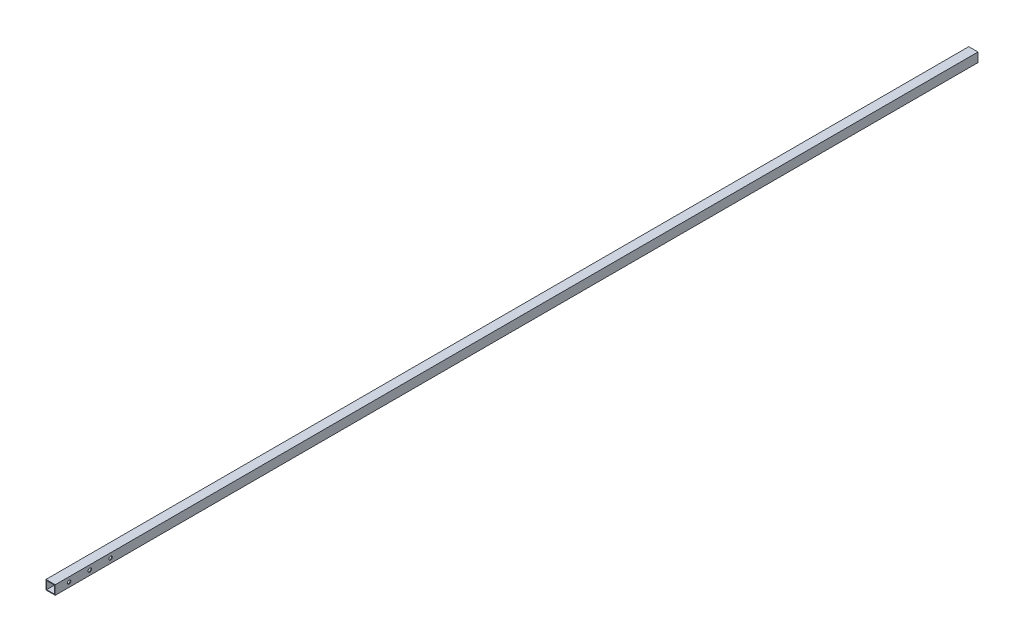
ISO-10303-21;
HEADER;
FILE_DESCRIPTION(('STEP AP214'),'2;1');
FILE_NAME('part.step','',(''),(''),'','','');
FILE_SCHEMA(('AUTOMOTIVE_DESIGN { 1 0 10303 214 1 1 1 1 }'));
ENDSEC;
DATA;
#1=APPLICATION_CONTEXT('core data for automotive mechanical design processes');
#2=APPLICATION_PROTOCOL_DEFINITION('international standard','automotive_design',2000,#1);
#3=PRODUCT_CONTEXT('',#1,'mechanical');
#4=PRODUCT('Part','Part','',(#3));
#5=PRODUCT_RELATED_PRODUCT_CATEGORY('part','',(#4));
#6=PRODUCT_DEFINITION_FORMATION('','',#4);
#7=PRODUCT_DEFINITION_CONTEXT('part definition',#1,'design');
#8=PRODUCT_DEFINITION('design','',#6,#7);
#9=PRODUCT_DEFINITION_SHAPE('','',#8);
#10=(LENGTH_UNIT() NAMED_UNIT(*) SI_UNIT(.MILLI.,.METRE.));
#11=(NAMED_UNIT(*) PLANE_ANGLE_UNIT() SI_UNIT($,.RADIAN.));
#12=(NAMED_UNIT(*) SI_UNIT($,.STERADIAN.) SOLID_ANGLE_UNIT());
#13=UNCERTAINTY_MEASURE_WITH_UNIT(LENGTH_MEASURE(1.E-05),#10,'distance_accuracy_value','');
#14=(GEOMETRIC_REPRESENTATION_CONTEXT(3) GLOBAL_UNCERTAINTY_ASSIGNED_CONTEXT((#13)) GLOBAL_UNIT_ASSIGNED_CONTEXT((#10,
#11,#12)) REPRESENTATION_CONTEXT('',''));
#15=CARTESIAN_POINT('',(0.,0.,0.));
#16=DIRECTION('',(0.,0.,1.));
#17=DIRECTION('',(1.,0.,0.));
#18=AXIS2_PLACEMENT_3D('',#15,#16,#17);
#19=CARTESIAN_POINT('',(0.,0.,4000.));
#20=DIRECTION('',(0.,0.,1.));
#21=DIRECTION('',(1.,0.,0.));
#22=AXIS2_PLACEMENT_3D('',#19,#20,#21);
#23=PLANE('',#22);
#24=DIRECTION('',(0.,1.,0.));
#25=VECTOR('',#24,1.);
#26=CARTESIAN_POINT('',(20.,20.,4000.));
#27=LINE('',#26,#25);
#28=CARTESIAN_POINT('',(20.,-20.,4000.));
#29=VERTEX_POINT('',#28);
#30=CARTESIAN_POINT('',(20.,20.,4000.));
#31=VERTEX_POINT('',#30);
#32=EDGE_CURVE('E144',#29,#31,#27,.T.);
#33=ORIENTED_EDGE('',*,*,#32,.T.);
#34=DIRECTION('',(-1.,0.,0.));
#35=VECTOR('',#34,1.);
#36=CARTESIAN_POINT('',(-20.,20.,4000.));
#37=LINE('',#36,#35);
#38=CARTESIAN_POINT('',(-20.,20.,4000.));
#39=VERTEX_POINT('',#38);
#40=EDGE_CURVE('E147',#31,#39,#37,.T.);
#41=ORIENTED_EDGE('',*,*,#40,.T.);
#42=DIRECTION('',(0.,-1.,0.));
#43=VECTOR('',#42,1.);
#44=CARTESIAN_POINT('',(-20.,20.,4000.));
#45=LINE('',#44,#43);
#46=CARTESIAN_POINT('',(-20.,-20.,4000.));
#47=VERTEX_POINT('',#46);
#48=EDGE_CURVE('E150',#39,#47,#45,.T.);
#49=ORIENTED_EDGE('',*,*,#48,.T.);
#50=DIRECTION('',(1.,0.,0.));
#51=VECTOR('',#50,1.);
#52=CARTESIAN_POINT('',(-20.,-20.,4000.));
#53=LINE('',#52,#51);
#54=EDGE_CURVE('E152',#47,#29,#53,.T.);
#55=ORIENTED_EDGE('',*,*,#54,.T.);
#56=EDGE_LOOP('',(#33,#41,#49,#55));
#57=FACE_BOUND('',#56,.T.);
#58=DIRECTION('',(1.,0.,0.));
#59=VECTOR('',#58,1.);
#60=CARTESIAN_POINT('',(-17.,-17.,4000.));
#61=LINE('',#60,#59);
#62=CARTESIAN_POINT('',(-17.,-17.,4000.));
#63=VERTEX_POINT('',#62);
#64=CARTESIAN_POINT('',(17.,-17.,4000.));
#65=VERTEX_POINT('',#64);
#66=EDGE_CURVE('E114',#63,#65,#61,.T.);
#67=ORIENTED_EDGE('',*,*,#66,.F.);
#68=DIRECTION('',(0.,-1.,0.));
#69=VECTOR('',#68,1.);
#70=CARTESIAN_POINT('',(-17.,17.,4000.));
#71=LINE('',#70,#69);
#72=CARTESIAN_POINT('',(-17.,17.,4000.));
#73=VERTEX_POINT('',#72);
#74=EDGE_CURVE('E106',#73,#63,#71,.T.);
#75=ORIENTED_EDGE('',*,*,#74,.F.);
#76=DIRECTION('',(-1.,0.,0.));
#77=VECTOR('',#76,1.);
#78=CARTESIAN_POINT('',(-17.,17.,4000.));
#79=LINE('',#78,#77);
#80=CARTESIAN_POINT('',(17.,17.,4000.));
#81=VERTEX_POINT('',#80);
#82=EDGE_CURVE('E128',#81,#73,#79,.T.);
#83=ORIENTED_EDGE('',*,*,#82,.F.);
#84=DIRECTION('',(0.,1.,0.));
#85=VECTOR('',#84,1.);
#86=CARTESIAN_POINT('',(17.,17.,4000.));
#87=LINE('',#86,#85);
#88=EDGE_CURVE('E126',#65,#81,#87,.T.);
#89=ORIENTED_EDGE('',*,*,#88,.F.);
#90=EDGE_LOOP('',(#67,#75,#83,#89));
#91=FACE_BOUND('',#90,.T.);
#92=ADVANCED_FACE('F39',(#57,#91),#23,.T.);
#93=CARTESIAN_POINT('',(0.,0.,0.));
#94=DIRECTION('',(0.,0.,1.));
#95=DIRECTION('',(1.,0.,0.));
#96=AXIS2_PLACEMENT_3D('',#93,#94,#95);
#97=PLANE('',#96);
#98=DIRECTION('',(0.,1.,0.));
#99=VECTOR('',#98,1.);
#100=CARTESIAN_POINT('',(20.,20.,0.));
#101=LINE('',#100,#99);
#102=CARTESIAN_POINT('',(20.,-20.,0.));
#103=VERTEX_POINT('',#102);
#104=CARTESIAN_POINT('',(20.,20.,0.));
#105=VERTEX_POINT('',#104);
#106=EDGE_CURVE('E122',#103,#105,#101,.T.);
#107=ORIENTED_EDGE('',*,*,#106,.F.);
#108=DIRECTION('',(1.,0.,0.));
#109=VECTOR('',#108,1.);
#110=CARTESIAN_POINT('',(-20.,-20.,0.));
#111=LINE('',#110,#109);
#112=CARTESIAN_POINT('',(-20.,-20.,0.));
#113=VERTEX_POINT('',#112);
#114=EDGE_CURVE('E148',#113,#103,#111,.T.);
#115=ORIENTED_EDGE('',*,*,#114,.F.);
#116=DIRECTION('',(0.,-1.,0.));
#117=VECTOR('',#116,1.);
#118=CARTESIAN_POINT('',(-20.,20.,0.));
#119=LINE('',#118,#117);
#120=CARTESIAN_POINT('',(-20.,20.,0.));
#121=VERTEX_POINT('',#120);
#122=EDGE_CURVE('E159',#121,#113,#119,.T.);
#123=ORIENTED_EDGE('',*,*,#122,.F.);
#124=DIRECTION('',(-1.,0.,0.));
#125=VECTOR('',#124,1.);
#126=CARTESIAN_POINT('',(-20.,20.,0.));
#127=LINE('',#126,#125);
#128=EDGE_CURVE('E157',#105,#121,#127,.T.);
#129=ORIENTED_EDGE('',*,*,#128,.F.);
#130=EDGE_LOOP('',(#107,#115,#123,#129));
#131=FACE_BOUND('',#130,.T.);
#132=DIRECTION('',(0.,-1.,0.));
#133=VECTOR('',#132,1.);
#134=CARTESIAN_POINT('',(-17.,17.,0.));
#135=LINE('',#134,#133);
#136=CARTESIAN_POINT('',(-17.,17.,0.));
#137=VERTEX_POINT('',#136);
#138=CARTESIAN_POINT('',(-17.,-17.,0.));
#139=VERTEX_POINT('',#138);
#140=EDGE_CURVE('E64',#137,#139,#135,.T.);
#141=ORIENTED_EDGE('',*,*,#140,.T.);
#142=DIRECTION('',(1.,0.,0.));
#143=VECTOR('',#142,1.);
#144=CARTESIAN_POINT('',(-17.,-17.,0.));
#145=LINE('',#144,#143);
#146=CARTESIAN_POINT('',(17.,-17.,0.));
#147=VERTEX_POINT('',#146);
#148=EDGE_CURVE('E121',#139,#147,#145,.T.);
#149=ORIENTED_EDGE('',*,*,#148,.T.);
#150=DIRECTION('',(0.,1.,0.));
#151=VECTOR('',#150,1.);
#152=CARTESIAN_POINT('',(17.,17.,0.));
#153=LINE('',#152,#151);
#154=CARTESIAN_POINT('',(17.,17.,0.));
#155=VERTEX_POINT('',#154);
#156=EDGE_CURVE('E136',#147,#155,#153,.T.);
#157=ORIENTED_EDGE('',*,*,#156,.T.);
#158=DIRECTION('',(-1.,0.,0.));
#159=VECTOR('',#158,1.);
#160=CARTESIAN_POINT('',(-17.,17.,0.));
#161=LINE('',#160,#159);
#162=EDGE_CURVE('E115',#155,#137,#161,.T.);
#163=ORIENTED_EDGE('',*,*,#162,.T.);
#164=EDGE_LOOP('',(#141,#149,#157,#163));
#165=FACE_BOUND('',#164,.T.);
#166=ADVANCED_FACE('F206',(#131,#165),#97,.F.);
#167=CARTESIAN_POINT('',(20.,20.,4000.));
#168=DIRECTION('',(-1.,0.,0.));
#169=DIRECTION('',(0.,-1.,0.));
#170=AXIS2_PLACEMENT_3D('',#167,#168,#169);
#171=PLANE('',#170);
#172=CARTESIAN_POINT('',(20.,0.,3940.));
#173=DIRECTION('',(1.,0.,0.));
#174=DIRECTION('',(0.,1.,0.));
#175=AXIS2_PLACEMENT_3D('',#172,#173,#174);
#176=CIRCLE('',#175,7.49999999999995);
#177=CARTESIAN_POINT('',(20.,7.49999999999995,3940.));
#178=VERTEX_POINT('',#177);
#179=EDGE_CURVE('E260',#178,#178,#176,.T.);
#180=ORIENTED_EDGE('',*,*,#179,.F.);
#181=EDGE_LOOP('',(#180));
#182=FACE_BOUND('',#181,.T.);
#183=CARTESIAN_POINT('',(20.,0.,3850.));
#184=DIRECTION('',(1.,0.,0.));
#185=DIRECTION('',(0.,1.,0.));
#186=AXIS2_PLACEMENT_3D('',#183,#184,#185);
#187=CIRCLE('',#186,7.49999999999995);
#188=CARTESIAN_POINT('',(20.,7.49999999999995,3850.));
#189=VERTEX_POINT('',#188);
#190=EDGE_CURVE('E264',#189,#189,#187,.T.);
#191=ORIENTED_EDGE('',*,*,#190,.F.);
#192=EDGE_LOOP('',(#191));
#193=FACE_BOUND('',#192,.T.);
#194=CARTESIAN_POINT('',(20.,0.,3760.));
#195=DIRECTION('',(1.,0.,0.));
#196=DIRECTION('',(0.,1.,0.));
#197=AXIS2_PLACEMENT_3D('',#194,#195,#196);
#198=CIRCLE('',#197,7.49999999999995);
#199=CARTESIAN_POINT('',(20.,7.49999999999995,3760.));
#200=VERTEX_POINT('',#199);
#201=EDGE_CURVE('E185',#200,#200,#198,.T.);
#202=ORIENTED_EDGE('',*,*,#201,.F.);
#203=EDGE_LOOP('',(#202));
#204=FACE_BOUND('',#203,.T.);
#205=ORIENTED_EDGE('',*,*,#106,.T.);
#206=DIRECTION('',(0.,0.,-1.));
#207=VECTOR('',#206,1.);
#208=CARTESIAN_POINT('',(20.,20.,4000.));
#209=LINE('',#208,#207);
#210=EDGE_CURVE('E11',#31,#105,#209,.T.);
#211=ORIENTED_EDGE('',*,*,#210,.F.);
#212=ORIENTED_EDGE('',*,*,#32,.F.);
#213=DIRECTION('',(0.,0.,-1.));
#214=VECTOR('',#213,1.);
#215=CARTESIAN_POINT('',(20.,-20.,4000.));
#216=LINE('',#215,#214);
#217=EDGE_CURVE('E154',#29,#103,#216,.T.);
#218=ORIENTED_EDGE('',*,*,#217,.T.);
#219=EDGE_LOOP('',(#205,#211,#212,#218));
#220=FACE_BOUND('',#219,.T.);
#221=ADVANCED_FACE('F41',(#182,#193,#204,#220),#171,.F.);
#222=CARTESIAN_POINT('',(-20.,20.,4000.));
#223=DIRECTION('',(0.,-1.,0.));
#224=DIRECTION('',(0.,0.,-1.));
#225=AXIS2_PLACEMENT_3D('',#222,#223,#224);
#226=PLANE('',#225);
#227=ORIENTED_EDGE('',*,*,#128,.T.);
#228=DIRECTION('',(0.,0.,-1.));
#229=VECTOR('',#228,1.);
#230=CARTESIAN_POINT('',(-20.,20.,4000.));
#231=LINE('',#230,#229);
#232=EDGE_CURVE('E48',#39,#121,#231,.T.);
#233=ORIENTED_EDGE('',*,*,#232,.F.);
#234=ORIENTED_EDGE('',*,*,#40,.F.);
#235=ORIENTED_EDGE('',*,*,#210,.T.);
#236=EDGE_LOOP('',(#227,#233,#234,#235));
#237=FACE_BOUND('',#236,.T.);
#238=ADVANCED_FACE('F236',(#237),#226,.F.);
#239=CARTESIAN_POINT('',(-20.,20.,4000.));
#240=DIRECTION('',(1.,0.,0.));
#241=DIRECTION('',(0.,1.,0.));
#242=AXIS2_PLACEMENT_3D('',#239,#240,#241);
#243=PLANE('',#242);
#244=CARTESIAN_POINT('',(-20.,0.,3940.));
#245=DIRECTION('',(1.,0.,0.));
#246=DIRECTION('',(0.,1.,0.));
#247=AXIS2_PLACEMENT_3D('',#244,#245,#246);
#248=CIRCLE('',#247,7.49999999999995);
#249=CARTESIAN_POINT('',(-20.,7.49999999999994,3940.));
#250=VERTEX_POINT('',#249);
#251=EDGE_CURVE('E172',#250,#250,#248,.T.);
#252=ORIENTED_EDGE('',*,*,#251,.T.);
#253=EDGE_LOOP('',(#252));
#254=FACE_BOUND('',#253,.T.);
#255=CARTESIAN_POINT('',(-20.,0.,3850.));
#256=DIRECTION('',(1.,0.,0.));
#257=DIRECTION('',(0.,1.,0.));
#258=AXIS2_PLACEMENT_3D('',#255,#256,#257);
#259=CIRCLE('',#258,7.49999999999995);
#260=CARTESIAN_POINT('',(-20.,7.49999999999994,3850.));
#261=VERTEX_POINT('',#260);
#262=EDGE_CURVE('E272',#261,#261,#259,.T.);
#263=ORIENTED_EDGE('',*,*,#262,.T.);
#264=EDGE_LOOP('',(#263));
#265=FACE_BOUND('',#264,.T.);
#266=CARTESIAN_POINT('',(-20.,0.,3760.));
#267=DIRECTION('',(1.,0.,0.));
#268=DIRECTION('',(0.,1.,0.));
#269=AXIS2_PLACEMENT_3D('',#266,#267,#268);
#270=CIRCLE('',#269,7.49999999999995);
#271=CARTESIAN_POINT('',(-20.,7.49999999999994,3760.));
#272=VERTEX_POINT('',#271);
#273=EDGE_CURVE('E268',#272,#272,#270,.T.);
#274=ORIENTED_EDGE('',*,*,#273,.T.);
#275=EDGE_LOOP('',(#274));
#276=FACE_BOUND('',#275,.T.);
#277=ORIENTED_EDGE('',*,*,#122,.T.);
#278=DIRECTION('',(0.,0.,-1.));
#279=VECTOR('',#278,1.);
#280=CARTESIAN_POINT('',(-20.,-20.,4000.));
#281=LINE('',#280,#279);
#282=EDGE_CURVE('E164',#47,#113,#281,.T.);
#283=ORIENTED_EDGE('',*,*,#282,.F.);
#284=ORIENTED_EDGE('',*,*,#48,.F.);
#285=ORIENTED_EDGE('',*,*,#232,.T.);
#286=EDGE_LOOP('',(#277,#283,#284,#285));
#287=FACE_BOUND('',#286,.T.);
#288=ADVANCED_FACE('F233',(#254,#265,#276,#287),#243,.F.);
#289=CARTESIAN_POINT('',(-20.,-20.,4000.));
#290=DIRECTION('',(0.,1.,0.));
#291=DIRECTION('',(0.,0.,1.));
#292=AXIS2_PLACEMENT_3D('',#289,#290,#291);
#293=PLANE('',#292);
#294=ORIENTED_EDGE('',*,*,#114,.T.);
#295=ORIENTED_EDGE('',*,*,#217,.F.);
#296=ORIENTED_EDGE('',*,*,#54,.F.);
#297=ORIENTED_EDGE('',*,*,#282,.T.);
#298=EDGE_LOOP('',(#294,#295,#296,#297));
#299=FACE_BOUND('',#298,.T.);
#300=ADVANCED_FACE('F230',(#299),#293,.F.);
#301=CARTESIAN_POINT('',(-17.,17.,4000.));
#302=DIRECTION('',(1.,0.,0.));
#303=DIRECTION('',(0.,0.,-1.));
#304=AXIS2_PLACEMENT_3D('',#301,#302,#303);
#305=PLANE('',#304);
#306=CARTESIAN_POINT('',(-17.,0.,3940.));
#307=DIRECTION('',(1.,0.,0.));
#308=DIRECTION('',(0.,0.,-1.));
#309=AXIS2_PLACEMENT_3D('',#306,#307,#308);
#310=CIRCLE('',#309,7.49999999999995);
#311=CARTESIAN_POINT('',(-17.,0.,3932.5));
#312=VERTEX_POINT('',#311);
#313=EDGE_CURVE('E134',#312,#312,#310,.T.);
#314=ORIENTED_EDGE('',*,*,#313,.F.);
#315=EDGE_LOOP('',(#314));
#316=FACE_BOUND('',#315,.T.);
#317=CARTESIAN_POINT('',(-17.,0.,3850.));
#318=DIRECTION('',(1.,0.,0.));
#319=DIRECTION('',(0.,0.,-1.));
#320=AXIS2_PLACEMENT_3D('',#317,#318,#319);
#321=CIRCLE('',#320,7.49999999999995);
#322=CARTESIAN_POINT('',(-17.,0.,3842.5));
#323=VERTEX_POINT('',#322);
#324=EDGE_CURVE('E175',#323,#323,#321,.T.);
#325=ORIENTED_EDGE('',*,*,#324,.F.);
#326=EDGE_LOOP('',(#325));
#327=FACE_BOUND('',#326,.T.);
#328=CARTESIAN_POINT('',(-17.,0.,3760.));
#329=DIRECTION('',(1.,0.,0.));
#330=DIRECTION('',(0.,0.,-1.));
#331=AXIS2_PLACEMENT_3D('',#328,#329,#330);
#332=CIRCLE('',#331,7.49999999999995);
#333=CARTESIAN_POINT('',(-17.,0.,3752.5));
#334=VERTEX_POINT('',#333);
#335=EDGE_CURVE('E171',#334,#334,#332,.T.);
#336=ORIENTED_EDGE('',*,*,#335,.F.);
#337=EDGE_LOOP('',(#336));
#338=FACE_BOUND('',#337,.T.);
#339=ORIENTED_EDGE('',*,*,#140,.F.);
#340=DIRECTION('',(0.,0.,-1.));
#341=VECTOR('',#340,1.);
#342=CARTESIAN_POINT('',(-17.,17.,4000.));
#343=LINE('',#342,#341);
#344=EDGE_CURVE('E110',#73,#137,#343,.T.);
#345=ORIENTED_EDGE('',*,*,#344,.F.);
#346=ORIENTED_EDGE('',*,*,#74,.T.);
#347=DIRECTION('',(0.,0.,-1.));
#348=VECTOR('',#347,1.);
#349=CARTESIAN_POINT('',(-17.,-17.,4000.));
#350=LINE('',#349,#348);
#351=EDGE_CURVE('E109',#63,#139,#350,.T.);
#352=ORIENTED_EDGE('',*,*,#351,.T.);
#353=EDGE_LOOP('',(#339,#345,#346,#352));
#354=FACE_BOUND('',#353,.T.);
#355=ADVANCED_FACE('F108',(#316,#327,#338,#354),#305,.T.);
#356=CARTESIAN_POINT('',(-17.,-17.,4000.));
#357=DIRECTION('',(0.,1.,0.));
#358=DIRECTION('',(-1.,0.,0.));
#359=AXIS2_PLACEMENT_3D('',#356,#357,#358);
#360=PLANE('',#359);
#361=ORIENTED_EDGE('',*,*,#148,.F.);
#362=ORIENTED_EDGE('',*,*,#351,.F.);
#363=ORIENTED_EDGE('',*,*,#66,.T.);
#364=DIRECTION('',(0.,0.,-1.));
#365=VECTOR('',#364,1.);
#366=CARTESIAN_POINT('',(17.,-17.,4000.));
#367=LINE('',#366,#365);
#368=EDGE_CURVE('E123',#65,#147,#367,.T.);
#369=ORIENTED_EDGE('',*,*,#368,.T.);
#370=EDGE_LOOP('',(#361,#362,#363,#369));
#371=FACE_BOUND('',#370,.T.);
#372=ADVANCED_FACE('F118',(#371),#360,.T.);
#373=CARTESIAN_POINT('',(17.,17.,4000.));
#374=DIRECTION('',(-1.,0.,0.));
#375=DIRECTION('',(0.,0.,1.));
#376=AXIS2_PLACEMENT_3D('',#373,#374,#375);
#377=PLANE('',#376);
#378=CARTESIAN_POINT('',(17.,0.,3940.));
#379=DIRECTION('',(-1.,0.,0.));
#380=DIRECTION('',(0.,0.,1.));
#381=AXIS2_PLACEMENT_3D('',#378,#379,#380);
#382=CIRCLE('',#381,7.49999999999995);
#383=CARTESIAN_POINT('',(17.,0.,3947.5));
#384=VERTEX_POINT('',#383);
#385=EDGE_CURVE('E43',#384,#384,#382,.T.);
#386=ORIENTED_EDGE('',*,*,#385,.F.);
#387=EDGE_LOOP('',(#386));
#388=FACE_BOUND('',#387,.T.);
#389=CARTESIAN_POINT('',(17.,0.,3850.));
#390=DIRECTION('',(-1.,0.,0.));
#391=DIRECTION('',(0.,0.,1.));
#392=AXIS2_PLACEMENT_3D('',#389,#390,#391);
#393=CIRCLE('',#392,7.49999999999995);
#394=CARTESIAN_POINT('',(17.,0.,3857.5));
#395=VERTEX_POINT('',#394);
#396=EDGE_CURVE('E173',#395,#395,#393,.T.);
#397=ORIENTED_EDGE('',*,*,#396,.F.);
#398=EDGE_LOOP('',(#397));
#399=FACE_BOUND('',#398,.T.);
#400=CARTESIAN_POINT('',(17.,0.,3760.));
#401=DIRECTION('',(-1.,0.,0.));
#402=DIRECTION('',(0.,0.,1.));
#403=AXIS2_PLACEMENT_3D('',#400,#401,#402);
#404=CIRCLE('',#403,7.49999999999995);
#405=CARTESIAN_POINT('',(17.,0.,3767.5));
#406=VERTEX_POINT('',#405);
#407=EDGE_CURVE('E169',#406,#406,#404,.T.);
#408=ORIENTED_EDGE('',*,*,#407,.F.);
#409=EDGE_LOOP('',(#408));
#410=FACE_BOUND('',#409,.T.);
#411=ORIENTED_EDGE('',*,*,#156,.F.);
#412=ORIENTED_EDGE('',*,*,#368,.F.);
#413=ORIENTED_EDGE('',*,*,#88,.T.);
#414=DIRECTION('',(0.,0.,-1.));
#415=VECTOR('',#414,1.);
#416=CARTESIAN_POINT('',(17.,17.,4000.));
#417=LINE('',#416,#415);
#418=EDGE_CURVE('E56',#81,#155,#417,.T.);
#419=ORIENTED_EDGE('',*,*,#418,.T.);
#420=EDGE_LOOP('',(#411,#412,#413,#419));
#421=FACE_BOUND('',#420,.T.);
#422=ADVANCED_FACE('F196',(#388,#399,#410,#421),#377,.T.);
#423=CARTESIAN_POINT('',(-17.,17.,4000.));
#424=DIRECTION('',(0.,-1.,0.));
#425=DIRECTION('',(0.,0.,-1.));
#426=AXIS2_PLACEMENT_3D('',#423,#424,#425);
#427=PLANE('',#426);
#428=ORIENTED_EDGE('',*,*,#162,.F.);
#429=ORIENTED_EDGE('',*,*,#418,.F.);
#430=ORIENTED_EDGE('',*,*,#82,.T.);
#431=ORIENTED_EDGE('',*,*,#344,.T.);
#432=EDGE_LOOP('',(#428,#429,#430,#431));
#433=FACE_BOUND('',#432,.T.);
#434=ADVANCED_FACE('F199',(#433),#427,.T.);
#435=CARTESIAN_POINT('',(-20.,0.,3760.));
#436=DIRECTION('',(1.,0.,0.));
#437=DIRECTION('',(0.,1.,0.));
#438=AXIS2_PLACEMENT_3D('',#435,#436,#437);
#439=CYLINDRICAL_SURFACE('',#438,7.49999999999995);
#440=ORIENTED_EDGE('',*,*,#407,.T.);
#441=EDGE_LOOP('',(#440));
#442=FACE_BOUND('',#441,.T.);
#443=ORIENTED_EDGE('',*,*,#201,.T.);
#444=EDGE_LOOP('',(#443));
#445=FACE_BOUND('',#444,.T.);
#446=ADVANCED_FACE('F208',(#442,#445),#439,.F.);
#447=CARTESIAN_POINT('',(-20.,0.,3850.));
#448=DIRECTION('',(1.,0.,0.));
#449=DIRECTION('',(0.,1.,0.));
#450=AXIS2_PLACEMENT_3D('',#447,#448,#449);
#451=CYLINDRICAL_SURFACE('',#450,7.49999999999995);
#452=ORIENTED_EDGE('',*,*,#396,.T.);
#453=EDGE_LOOP('',(#452));
#454=FACE_BOUND('',#453,.T.);
#455=ORIENTED_EDGE('',*,*,#190,.T.);
#456=EDGE_LOOP('',(#455));
#457=FACE_BOUND('',#456,.T.);
#458=ADVANCED_FACE('F215',(#454,#457),#451,.F.);
#459=CARTESIAN_POINT('',(-20.,0.,3940.));
#460=DIRECTION('',(1.,0.,0.));
#461=DIRECTION('',(0.,1.,0.));
#462=AXIS2_PLACEMENT_3D('',#459,#460,#461);
#463=CYLINDRICAL_SURFACE('',#462,7.49999999999995);
#464=ORIENTED_EDGE('',*,*,#385,.T.);
#465=EDGE_LOOP('',(#464));
#466=FACE_BOUND('',#465,.T.);
#467=ORIENTED_EDGE('',*,*,#179,.T.);
#468=EDGE_LOOP('',(#467));
#469=FACE_BOUND('',#468,.T.);
#470=ADVANCED_FACE('F193',(#466,#469),#463,.F.);
#471=ORIENTED_EDGE('',*,*,#335,.T.);
#472=EDGE_LOOP('',(#471));
#473=FACE_BOUND('',#472,.T.);
#474=ORIENTED_EDGE('',*,*,#273,.F.);
#475=EDGE_LOOP('',(#474));
#476=FACE_BOUND('',#475,.T.);
#477=ADVANCED_FACE('F218',(#473,#476),#439,.F.);
#478=ORIENTED_EDGE('',*,*,#324,.T.);
#479=EDGE_LOOP('',(#478));
#480=FACE_BOUND('',#479,.T.);
#481=ORIENTED_EDGE('',*,*,#262,.F.);
#482=EDGE_LOOP('',(#481));
#483=FACE_BOUND('',#482,.T.);
#484=ADVANCED_FACE('F284',(#480,#483),#451,.F.);
#485=ORIENTED_EDGE('',*,*,#313,.T.);
#486=EDGE_LOOP('',(#485));
#487=FACE_BOUND('',#486,.T.);
#488=ORIENTED_EDGE('',*,*,#251,.F.);
#489=EDGE_LOOP('',(#488));
#490=FACE_BOUND('',#489,.T.);
#491=ADVANCED_FACE('F282',(#487,#490),#463,.F.);
#492=CLOSED_SHELL('',(#92,#166,#221,#238,#288,#300,#355,#372,#422,#434,#446,#458,#470,#477,#484,#491));
#493=MANIFOLD_SOLID_BREP('B2',#492);
#494=ADVANCED_BREP_SHAPE_REPRESENTATION('',(#18,#493),#14);
#495=SHAPE_DEFINITION_REPRESENTATION(#9,#494);
ENDSEC;
END-ISO-10303-21;
